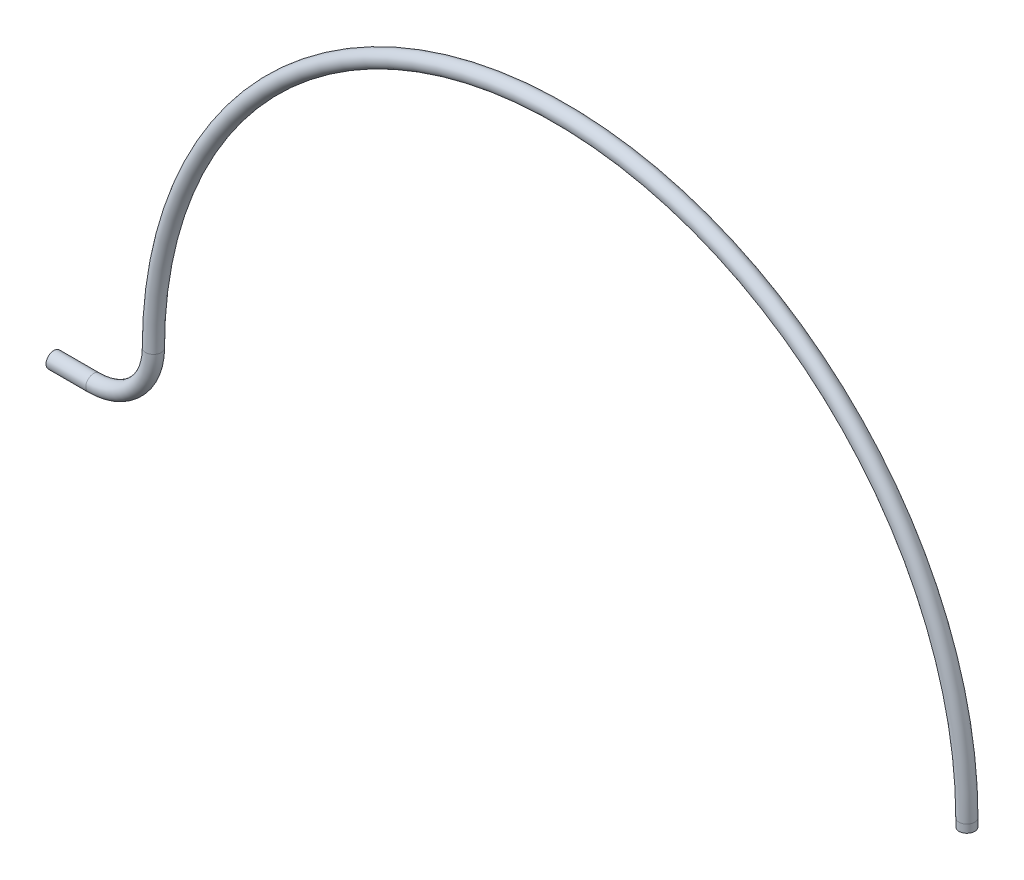
ISO-10303-21;
HEADER;
FILE_DESCRIPTION(('STEP AP214'),'2;1');
FILE_NAME('part.step','',(''),(''),'','','');
FILE_SCHEMA(('AUTOMOTIVE_DESIGN { 1 0 10303 214 1 1 1 1 }'));
ENDSEC;
DATA;
#1=APPLICATION_CONTEXT('core data for automotive mechanical design processes');
#2=APPLICATION_PROTOCOL_DEFINITION('international standard','automotive_design',2000,#1);
#3=PRODUCT_CONTEXT('',#1,'mechanical');
#4=PRODUCT('Part','Part','',(#3));
#5=PRODUCT_RELATED_PRODUCT_CATEGORY('part','',(#4));
#6=PRODUCT_DEFINITION_FORMATION('','',#4);
#7=PRODUCT_DEFINITION_CONTEXT('part definition',#1,'design');
#8=PRODUCT_DEFINITION('design','',#6,#7);
#9=PRODUCT_DEFINITION_SHAPE('','',#8);
#10=(LENGTH_UNIT() NAMED_UNIT(*) SI_UNIT(.MILLI.,.METRE.));
#11=(NAMED_UNIT(*) PLANE_ANGLE_UNIT() SI_UNIT($,.RADIAN.));
#12=(NAMED_UNIT(*) SI_UNIT($,.STERADIAN.) SOLID_ANGLE_UNIT());
#13=UNCERTAINTY_MEASURE_WITH_UNIT(LENGTH_MEASURE(1.E-05),#10,'distance_accuracy_value','');
#14=(GEOMETRIC_REPRESENTATION_CONTEXT(3) GLOBAL_UNCERTAINTY_ASSIGNED_CONTEXT((#13)) GLOBAL_UNIT_ASSIGNED_CONTEXT((#10,
#11,#12)) REPRESENTATION_CONTEXT('',''));
#15=CARTESIAN_POINT('',(0.,0.,0.));
#16=DIRECTION('',(0.,0.,1.));
#17=DIRECTION('',(1.,0.,0.));
#18=AXIS2_PLACEMENT_3D('',#15,#16,#17);
#19=CARTESIAN_POINT('',(-912.402789465059,-28.1050973915147,0.));
#20=DIRECTION('',(0.,0.,1.));
#21=DIRECTION('',(1.,0.,0.));
#22=AXIS2_PLACEMENT_3D('',#19,#20,#21);
#23=TOROIDAL_SURFACE('',#22,14.9999998428797,1.975);
#24=CARTESIAN_POINT('',(-897.402789622504,-28.1049987341977,0.));
#25=DIRECTION('',(-6.57715452863111E-06,0.999999999978371,0.));
#26=DIRECTION('',(-0.999999999978371,-6.57715452863112E-06,0.));
#27=AXIS2_PLACEMENT_3D('',#24,#25,#26);
#28=CIRCLE('',#27,1.975);
#29=CARTESIAN_POINT('',(-899.377789543901,-28.1050117240774,0.));
#30=VERTEX_POINT('',#29);
#31=EDGE_CURVE('E63',#30,#30,#28,.T.);
#32=ORIENTED_EDGE('',*,*,#31,.F.);
#33=EDGE_LOOP('',(#32));
#34=FACE_BOUND('',#33,.T.);
#35=CARTESIAN_POINT('',(-912.402789465059,-43.1050972343944,0.));
#36=DIRECTION('',(1.,1.57120316757187E-08,0.));
#37=DIRECTION('',(-1.57120316757187E-08,1.,0.));
#38=AXIS2_PLACEMENT_3D('',#35,#36,#37);
#39=CIRCLE('',#38,1.975);
#40=CARTESIAN_POINT('',(-912.40278949609,-41.1300972343944,0.));
#41=VERTEX_POINT('',#40);
#42=EDGE_CURVE('E61',#41,#41,#39,.T.);
#43=ORIENTED_EDGE('',*,*,#42,.T.);
#44=EDGE_LOOP('',(#43));
#45=FACE_BOUND('',#44,.T.);
#46=ADVANCED_FACE('F31',(#34,#45),#23,.T.);
#47=CARTESIAN_POINT('',(-795.219200988727,-28.1043266569451,0.));
#48=DIRECTION('',(0.,0.,-1.));
#49=DIRECTION('',(-1.,0.,0.));
#50=AXIS2_PLACEMENT_3D('',#47,#48,#49);
#51=TOROIDAL_SURFACE('',#50,102.183588557427,1.975);
#52=CARTESIAN_POINT('',(-693.0356124313,-28.1043266569451,0.));
#53=DIRECTION('',(0.,-1.,0.));
#54=DIRECTION('',(1.,0.,0.));
#55=AXIS2_PLACEMENT_3D('',#52,#53,#54);
#56=CIRCLE('',#55,1.975);
#57=CARTESIAN_POINT('',(-691.0606124313,-28.1043266569451,0.));
#58=VERTEX_POINT('',#57);
#59=EDGE_CURVE('E35',#58,#58,#56,.T.);
#60=CARTESIAN_POINT('',(-795.219200988727,-28.1043266569451,0.));
#61=DIRECTION('',(0.,0.,-1.));
#62=DIRECTION('',(-1.,0.,0.));
#63=AXIS2_PLACEMENT_3D('',#60,#61,#62);
#64=CIRCLE('',#63,104.158588557427);
#65=EDGE_CURVE('',#30,#58,#64,.T.);
#66=ORIENTED_EDGE('',*,*,#31,.T.);
#67=ORIENTED_EDGE('',*,*,#59,.F.);
#68=ORIENTED_EDGE('',*,*,#65,.T.);
#69=ORIENTED_EDGE('',*,*,#65,.F.);
#70=EDGE_LOOP('',(#66,#68,#67,#69));
#71=FACE_BOUND('',#70,.T.);
#72=ADVANCED_FACE('F71',(#71),#51,.T.);
#73=CARTESIAN_POINT('',(-693.0356124313,-28.1043266569451,0.));
#74=DIRECTION('',(0.,-1.,0.));
#75=DIRECTION('',(0.,0.,-1.));
#76=AXIS2_PLACEMENT_3D('',#73,#74,#75);
#77=CYLINDRICAL_SURFACE('',#76,1.975);
#78=CARTESIAN_POINT('',(-693.0356124313,-30.1043266569451,0.));
#79=DIRECTION('',(0.,-1.,0.));
#80=DIRECTION('',(1.,0.,0.));
#81=AXIS2_PLACEMENT_3D('',#78,#79,#80);
#82=CIRCLE('',#81,1.975);
#83=CARTESIAN_POINT('',(-691.0606124313,-30.1043266569451,0.));
#84=VERTEX_POINT('',#83);
#85=EDGE_CURVE('E58',#84,#84,#82,.T.);
#86=ORIENTED_EDGE('',*,*,#85,.F.);
#87=EDGE_LOOP('',(#86));
#88=FACE_BOUND('',#87,.T.);
#89=ORIENTED_EDGE('',*,*,#59,.T.);
#90=EDGE_LOOP('',(#89));
#91=FACE_BOUND('',#90,.T.);
#92=ADVANCED_FACE('F33',(#88,#91),#77,.T.);
#93=CARTESIAN_POINT('',(-922.402789465059,-43.1050973915147,0.));
#94=DIRECTION('',(1.,1.57120316757186E-08,0.));
#95=DIRECTION('',(-1.57120316757186E-08,1.,0.));
#96=AXIS2_PLACEMENT_3D('',#93,#94,#95);
#97=CYLINDRICAL_SURFACE('',#96,1.975);
#98=ORIENTED_EDGE('',*,*,#42,.F.);
#99=EDGE_LOOP('',(#98));
#100=FACE_BOUND('',#99,.T.);
#101=CARTESIAN_POINT('',(-922.402789465059,-43.1050973915147,0.));
#102=DIRECTION('',(1.,1.57120316757187E-08,0.));
#103=DIRECTION('',(-1.57120316757187E-08,1.,0.));
#104=AXIS2_PLACEMENT_3D('',#101,#102,#103);
#105=CIRCLE('',#104,1.975);
#106=CARTESIAN_POINT('',(-922.40278949609,-41.1300973915147,0.));
#107=VERTEX_POINT('',#106);
#108=EDGE_CURVE('E51',#107,#107,#105,.T.);
#109=ORIENTED_EDGE('',*,*,#108,.T.);
#110=EDGE_LOOP('',(#109));
#111=FACE_BOUND('',#110,.T.);
#112=ADVANCED_FACE('F77',(#100,#111),#97,.T.);
#113=CARTESIAN_POINT('',(-693.0356124313,-30.1043266569451,0.));
#114=DIRECTION('',(0.,-1.,0.));
#115=DIRECTION('',(1.,0.,0.));
#116=AXIS2_PLACEMENT_3D('',#113,#114,#115);
#117=PLANE('',#116);
#118=CARTESIAN_POINT('',(-693.0356124313,-30.1043266569451,0.));
#119=DIRECTION('',(0.,-1.,0.));
#120=DIRECTION('',(1.,0.,0.));
#121=AXIS2_PLACEMENT_3D('',#118,#119,#120);
#122=CIRCLE('',#121,0.95);
#123=CARTESIAN_POINT('',(-692.0856124313,-30.1043266569451,0.));
#124=VERTEX_POINT('',#123);
#125=EDGE_CURVE('E44',#124,#124,#122,.F.);
#126=ORIENTED_EDGE('',*,*,#125,.T.);
#127=EDGE_LOOP('',(#126));
#128=FACE_BOUND('',#127,.T.);
#129=ORIENTED_EDGE('',*,*,#85,.T.);
#130=EDGE_LOOP('',(#129));
#131=FACE_BOUND('',#130,.T.);
#132=ADVANCED_FACE('F104',(#128,#131),#117,.T.);
#133=CARTESIAN_POINT('',(-922.402789465059,-43.1050973915147,0.));
#134=DIRECTION('',(1.,1.57120316757187E-08,0.));
#135=DIRECTION('',(-1.57120316757187E-08,1.,0.));
#136=AXIS2_PLACEMENT_3D('',#133,#134,#135);
#137=PLANE('',#136);
#138=CARTESIAN_POINT('',(-922.402789465059,-43.1050973915147,0.));
#139=DIRECTION('',(1.,1.57120316757187E-08,0.));
#140=DIRECTION('',(-1.57120316757187E-08,1.,0.));
#141=AXIS2_PLACEMENT_3D('',#138,#139,#140);
#142=CIRCLE('',#141,0.95);
#143=CARTESIAN_POINT('',(-922.402789479986,-42.1550973915147,0.));
#144=VERTEX_POINT('',#143);
#145=EDGE_CURVE('E39',#144,#144,#142,.F.);
#146=ORIENTED_EDGE('',*,*,#145,.F.);
#147=EDGE_LOOP('',(#146));
#148=FACE_BOUND('',#147,.T.);
#149=ORIENTED_EDGE('',*,*,#108,.F.);
#150=EDGE_LOOP('',(#149));
#151=FACE_BOUND('',#150,.T.);
#152=ADVANCED_FACE('F97',(#148,#151),#137,.F.);
#153=CARTESIAN_POINT('',(-912.402789465059,-28.1050973915147,0.));
#154=DIRECTION('',(0.,0.,1.));
#155=DIRECTION('',(1.,0.,0.));
#156=AXIS2_PLACEMENT_3D('',#153,#154,#155);
#157=TOROIDAL_SURFACE('',#156,14.9999998428797,0.95);
#158=CARTESIAN_POINT('',(-897.402789622504,-28.1049987341977,0.));
#159=DIRECTION('',(-6.57715452863111E-06,0.999999999978371,0.));
#160=DIRECTION('',(-0.999999999978371,-6.57715452863112E-06,0.));
#161=AXIS2_PLACEMENT_3D('',#158,#159,#160);
#162=CIRCLE('',#161,0.95);
#163=CARTESIAN_POINT('',(-898.352789543923,-28.105004982494,0.));
#164=VERTEX_POINT('',#163);
#165=EDGE_CURVE('E47',#164,#164,#162,.F.);
#166=ORIENTED_EDGE('',*,*,#165,.F.);
#167=EDGE_LOOP('',(#166));
#168=FACE_BOUND('',#167,.T.);
#169=CARTESIAN_POINT('',(-912.402789465059,-43.1050972343944,0.));
#170=DIRECTION('',(1.,1.57120316757187E-08,0.));
#171=DIRECTION('',(-1.57120316757187E-08,1.,0.));
#172=AXIS2_PLACEMENT_3D('',#169,#170,#171);
#173=CIRCLE('',#172,0.95);
#174=CARTESIAN_POINT('',(-912.402789479986,-42.1550972343944,0.));
#175=VERTEX_POINT('',#174);
#176=EDGE_CURVE('E10',#175,#175,#173,.F.);
#177=ORIENTED_EDGE('',*,*,#176,.T.);
#178=EDGE_LOOP('',(#177));
#179=FACE_BOUND('',#178,.T.);
#180=ADVANCED_FACE('F94',(#168,#179),#157,.F.);
#181=CARTESIAN_POINT('',(-795.219200988727,-28.1043266569451,0.));
#182=DIRECTION('',(0.,0.,-1.));
#183=DIRECTION('',(-1.,0.,0.));
#184=AXIS2_PLACEMENT_3D('',#181,#182,#183);
#185=TOROIDAL_SURFACE('',#184,102.183588557427,0.95);
#186=CARTESIAN_POINT('',(-693.0356124313,-28.1043266569451,0.));
#187=DIRECTION('',(0.,-1.,0.));
#188=DIRECTION('',(1.,0.,0.));
#189=AXIS2_PLACEMENT_3D('',#186,#187,#188);
#190=CIRCLE('',#189,0.95);
#191=CARTESIAN_POINT('',(-692.0856124313,-28.1043266569451,0.));
#192=VERTEX_POINT('',#191);
#193=EDGE_CURVE('E50',#192,#192,#190,.F.);
#194=CARTESIAN_POINT('',(-795.219200988727,-28.1043266569451,0.));
#195=DIRECTION('',(0.,0.,-1.));
#196=DIRECTION('',(-1.,0.,0.));
#197=AXIS2_PLACEMENT_3D('',#194,#195,#196);
#198=CIRCLE('',#197,103.133588557427);
#199=EDGE_CURVE('',#164,#192,#198,.T.);
#200=ORIENTED_EDGE('',*,*,#165,.T.);
#201=ORIENTED_EDGE('',*,*,#193,.F.);
#202=ORIENTED_EDGE('',*,*,#199,.T.);
#203=ORIENTED_EDGE('',*,*,#199,.F.);
#204=EDGE_LOOP('',(#200,#202,#201,#203));
#205=FACE_BOUND('',#204,.T.);
#206=ADVANCED_FACE('F89',(#205),#185,.F.);
#207=CARTESIAN_POINT('',(-693.0356124313,-28.1043266569451,0.));
#208=DIRECTION('',(0.,-1.,0.));
#209=DIRECTION('',(0.,0.,-1.));
#210=AXIS2_PLACEMENT_3D('',#207,#208,#209);
#211=CYLINDRICAL_SURFACE('',#210,0.95);
#212=ORIENTED_EDGE('',*,*,#125,.F.);
#213=EDGE_LOOP('',(#212));
#214=FACE_BOUND('',#213,.T.);
#215=ORIENTED_EDGE('',*,*,#193,.T.);
#216=EDGE_LOOP('',(#215));
#217=FACE_BOUND('',#216,.T.);
#218=ADVANCED_FACE('F83',(#214,#217),#211,.F.);
#219=CARTESIAN_POINT('',(-922.402789465059,-43.1050973915147,0.));
#220=DIRECTION('',(1.,1.57120316757186E-08,0.));
#221=DIRECTION('',(-1.57120316757186E-08,1.,0.));
#222=AXIS2_PLACEMENT_3D('',#219,#220,#221);
#223=CYLINDRICAL_SURFACE('',#222,0.95);
#224=ORIENTED_EDGE('',*,*,#176,.F.);
#225=EDGE_LOOP('',(#224));
#226=FACE_BOUND('',#225,.T.);
#227=ORIENTED_EDGE('',*,*,#145,.T.);
#228=EDGE_LOOP('',(#227));
#229=FACE_BOUND('',#228,.T.);
#230=ADVANCED_FACE('F81',(#226,#229),#223,.F.);
#231=CLOSED_SHELL('',(#46,#72,#92,#112,#132,#152,#180,#206,#218,#230));
#232=MANIFOLD_SOLID_BREP('B2',#231);
#233=ADVANCED_BREP_SHAPE_REPRESENTATION('',(#18,#232),#14);
#234=SHAPE_DEFINITION_REPRESENTATION(#9,#233);
ENDSEC;
END-ISO-10303-21;
